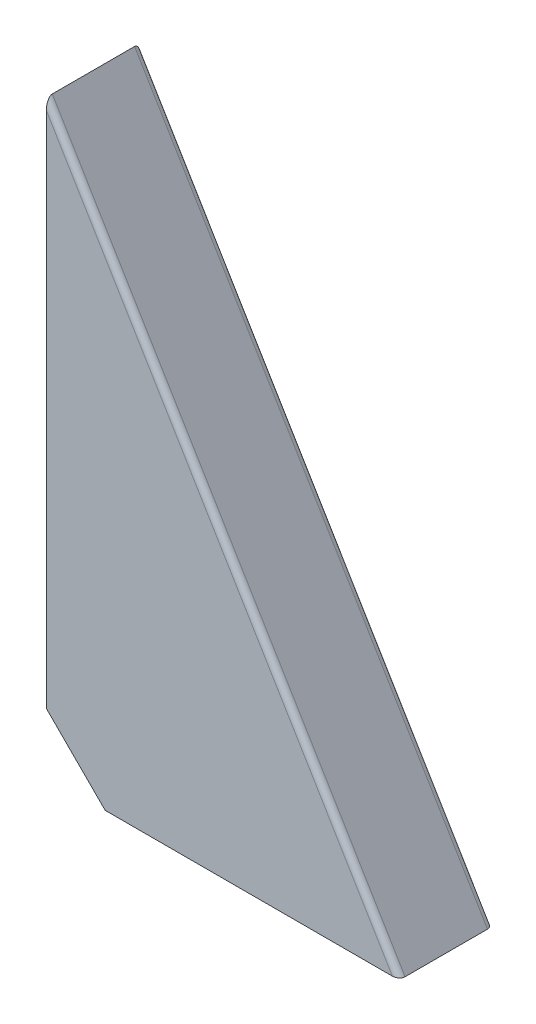
ISO-10303-21;
HEADER;
FILE_DESCRIPTION(('STEP AP214'),'2;1');
FILE_NAME('part.step','',(''),(''),'','','');
FILE_SCHEMA(('AUTOMOTIVE_DESIGN { 1 0 10303 214 1 1 1 1 }'));
ENDSEC;
DATA;
#1=APPLICATION_CONTEXT('core data for automotive mechanical design processes');
#2=APPLICATION_PROTOCOL_DEFINITION('international standard','automotive_design',2000,#1);
#3=PRODUCT_CONTEXT('',#1,'mechanical');
#4=PRODUCT('Part','Part','',(#3));
#5=PRODUCT_RELATED_PRODUCT_CATEGORY('part','',(#4));
#6=PRODUCT_DEFINITION_FORMATION('','',#4);
#7=PRODUCT_DEFINITION_CONTEXT('part definition',#1,'design');
#8=PRODUCT_DEFINITION('design','',#6,#7);
#9=PRODUCT_DEFINITION_SHAPE('','',#8);
#10=(LENGTH_UNIT() NAMED_UNIT(*) SI_UNIT(.MILLI.,.METRE.));
#11=(NAMED_UNIT(*) PLANE_ANGLE_UNIT() SI_UNIT($,.RADIAN.));
#12=(NAMED_UNIT(*) SI_UNIT($,.STERADIAN.) SOLID_ANGLE_UNIT());
#13=UNCERTAINTY_MEASURE_WITH_UNIT(LENGTH_MEASURE(1.E-05),#10,'distance_accuracy_value','');
#14=(GEOMETRIC_REPRESENTATION_CONTEXT(3) GLOBAL_UNCERTAINTY_ASSIGNED_CONTEXT((#13)) GLOBAL_UNIT_ASSIGNED_CONTEXT((#10,
#11,#12)) REPRESENTATION_CONTEXT('',''));
#15=CARTESIAN_POINT('',(0.,0.,0.));
#16=DIRECTION('',(0.,0.,1.));
#17=DIRECTION('',(1.,0.,0.));
#18=AXIS2_PLACEMENT_3D('',#15,#16,#17);
#19=CARTESIAN_POINT('',(0.,100.,8.));
#20=DIRECTION('',(1.,0.,0.));
#21=DIRECTION('',(0.,0.,-1.));
#22=AXIS2_PLACEMENT_3D('',#19,#20,#21);
#23=PLANE('',#22);
#24=DIRECTION('',(0.,-1.,0.));
#25=VECTOR('',#24,1.);
#26=CARTESIAN_POINT('',(0.,100.,8.));
#27=LINE('',#26,#25);
#28=CARTESIAN_POINT('',(0.,98.0563493683849,8.));
#29=VERTEX_POINT('',#28);
#30=CARTESIAN_POINT('',(0.,10.,8.));
#31=VERTEX_POINT('',#30);
#32=EDGE_CURVE('E123',#29,#31,#27,.T.);
#33=ORIENTED_EDGE('',*,*,#32,.F.);
#34=CARTESIAN_POINT('',(0.,98.0563493683849,7.));
#35=DIRECTION('',(1.,0.,0.));
#36=DIRECTION('',(0.,-1.,0.));
#37=AXIS2_PLACEMENT_3D('',#34,#35,#36);
#38=ELLIPSE('',#37,1.9436506316151,1.);
#39=CARTESIAN_POINT('',(0.,100.,7.));
#40=VERTEX_POINT('',#39);
#41=EDGE_CURVE('E140',#29,#40,#38,.F.);
#42=ORIENTED_EDGE('',*,*,#41,.T.);
#43=DIRECTION('',(0.,0.,-1.));
#44=VECTOR('',#43,1.);
#45=CARTESIAN_POINT('',(0.,100.,8.));
#46=LINE('',#45,#44);
#47=CARTESIAN_POINT('',(0.,100.,-7.));
#48=VERTEX_POINT('',#47);
#49=EDGE_CURVE('E130',#40,#48,#46,.T.);
#50=ORIENTED_EDGE('',*,*,#49,.T.);
#51=CARTESIAN_POINT('',(0.,98.0563493683849,-7.));
#52=DIRECTION('',(1.,0.,0.));
#53=DIRECTION('',(0.,1.,0.));
#54=AXIS2_PLACEMENT_3D('',#51,#52,#53);
#55=ELLIPSE('',#54,1.9436506316151,1.);
#56=CARTESIAN_POINT('',(0.,98.0563493683849,-8.));
#57=VERTEX_POINT('',#56);
#58=EDGE_CURVE('E138',#48,#57,#55,.F.);
#59=ORIENTED_EDGE('',*,*,#58,.T.);
#60=DIRECTION('',(0.,-1.,0.));
#61=VECTOR('',#60,1.);
#62=CARTESIAN_POINT('',(0.,100.,-8.));
#63=LINE('',#62,#61);
#64=CARTESIAN_POINT('',(0.,9.99999999999999,-8.));
#65=VERTEX_POINT('',#64);
#66=EDGE_CURVE('E124',#57,#65,#63,.T.);
#67=ORIENTED_EDGE('',*,*,#66,.T.);
#68=DIRECTION('',(0.,0.,1.));
#69=VECTOR('',#68,1.);
#70=CARTESIAN_POINT('',(0.,10.,-8.));
#71=LINE('',#70,#69);
#72=EDGE_CURVE('E113',#65,#31,#71,.T.);
#73=ORIENTED_EDGE('',*,*,#72,.T.);
#74=EDGE_LOOP('',(#33,#42,#50,#59,#67,#73));
#75=FACE_BOUND('',#74,.T.);
#76=ADVANCED_FACE('F52',(#75),#23,.F.);
#77=CARTESIAN_POINT('',(0.,0.,8.));
#78=DIRECTION('',(0.,1.,0.));
#79=DIRECTION('',(0.,0.,1.));
#80=AXIS2_PLACEMENT_3D('',#77,#78,#79);
#81=PLANE('',#80);
#82=DIRECTION('',(0.,0.,-1.));
#83=VECTOR('',#82,1.);
#84=CARTESIAN_POINT('',(60.,0.,8.));
#85=LINE('',#84,#83);
#86=CARTESIAN_POINT('',(60.,0.,7.));
#87=VERTEX_POINT('',#86);
#88=CARTESIAN_POINT('',(60.,0.,-7.));
#89=VERTEX_POINT('',#88);
#90=EDGE_CURVE('E133',#87,#89,#85,.T.);
#91=ORIENTED_EDGE('',*,*,#90,.F.);
#92=CARTESIAN_POINT('',(58.8338096210309,0.,7.));
#93=DIRECTION('',(0.,1.,0.));
#94=DIRECTION('',(1.,0.,0.));
#95=AXIS2_PLACEMENT_3D('',#92,#93,#94);
#96=ELLIPSE('',#95,1.16619037896906,1.);
#97=CARTESIAN_POINT('',(58.8338096210309,0.,8.));
#98=VERTEX_POINT('',#97);
#99=EDGE_CURVE('E60',#87,#98,#96,.F.);
#100=ORIENTED_EDGE('',*,*,#99,.T.);
#101=DIRECTION('',(1.,0.,0.));
#102=VECTOR('',#101,1.);
#103=CARTESIAN_POINT('',(0.,0.,8.));
#104=LINE('',#103,#102);
#105=CARTESIAN_POINT('',(10.,0.,8.));
#106=VERTEX_POINT('',#105);
#107=EDGE_CURVE('E120',#106,#98,#104,.T.);
#108=ORIENTED_EDGE('',*,*,#107,.F.);
#109=DIRECTION('',(0.,0.,1.));
#110=VECTOR('',#109,1.);
#111=CARTESIAN_POINT('',(10.,0.,-8.));
#112=LINE('',#111,#110);
#113=CARTESIAN_POINT('',(10.,0.,-8.));
#114=VERTEX_POINT('',#113);
#115=EDGE_CURVE('E110',#114,#106,#112,.T.);
#116=ORIENTED_EDGE('',*,*,#115,.F.);
#117=DIRECTION('',(1.,0.,0.));
#118=VECTOR('',#117,1.);
#119=CARTESIAN_POINT('',(0.,0.,-8.));
#120=LINE('',#119,#118);
#121=CARTESIAN_POINT('',(58.8338096210309,0.,-8.));
#122=VERTEX_POINT('',#121);
#123=EDGE_CURVE('E118',#114,#122,#120,.T.);
#124=ORIENTED_EDGE('',*,*,#123,.T.);
#125=CARTESIAN_POINT('',(58.8338096210309,0.,-7.));
#126=DIRECTION('',(0.,1.,0.));
#127=DIRECTION('',(-1.,0.,0.));
#128=AXIS2_PLACEMENT_3D('',#125,#126,#127);
#129=ELLIPSE('',#128,1.16619037896906,1.);
#130=EDGE_CURVE('E72',#122,#89,#129,.F.);
#131=ORIENTED_EDGE('',*,*,#130,.T.);
#132=EDGE_LOOP('',(#91,#100,#108,#116,#124,#131));
#133=FACE_BOUND('',#132,.T.);
#134=ADVANCED_FACE('F117',(#133),#81,.F.);
#135=CARTESIAN_POINT('',(60.,0.,8.));
#136=DIRECTION('',(-0.857492925712544,-0.514495755427527,0.));
#137=DIRECTION('',(0.514495755427526,-0.857492925712544,0.));
#138=AXIS2_PLACEMENT_3D('',#135,#136,#137);
#139=PLANE('',#138);
#140=ORIENTED_EDGE('',*,*,#49,.F.);
#141=DIRECTION('',(-0.514495755427526,0.857492925712544,0.));
#142=VECTOR('',#141,1.);
#143=CARTESIAN_POINT('',(60.,0.,7.));
#144=LINE('',#143,#142);
#145=EDGE_CURVE('E145',#40,#87,#144,.F.);
#146=ORIENTED_EDGE('',*,*,#145,.T.);
#147=ORIENTED_EDGE('',*,*,#90,.T.);
#148=DIRECTION('',(-0.514495755427526,0.857492925712544,0.));
#149=VECTOR('',#148,1.);
#150=CARTESIAN_POINT('',(60.,0.,-7.));
#151=LINE('',#150,#149);
#152=EDGE_CURVE('E142',#89,#48,#151,.T.);
#153=ORIENTED_EDGE('',*,*,#152,.T.);
#154=EDGE_LOOP('',(#140,#146,#147,#153));
#155=FACE_BOUND('',#154,.T.);
#156=ADVANCED_FACE('F158',(#155),#139,.F.);
#157=CARTESIAN_POINT('',(0.,0.,8.));
#158=DIRECTION('',(0.,0.,1.));
#159=DIRECTION('',(1.,0.,0.));
#160=AXIS2_PLACEMENT_3D('',#157,#158,#159);
#161=PLANE('',#160);
#162=ORIENTED_EDGE('',*,*,#107,.T.);
#163=DIRECTION('',(-0.514495755427526,0.857492925712544,0.));
#164=VECTOR('',#163,1.);
#165=CARTESIAN_POINT('',(-0.857492925712529,99.4855042445725,8.));
#166=LINE('',#165,#164);
#167=EDGE_CURVE('E135',#98,#29,#166,.T.);
#168=ORIENTED_EDGE('',*,*,#167,.T.);
#169=ORIENTED_EDGE('',*,*,#32,.T.);
#170=DIRECTION('',(-0.707106781186548,0.707106781186547,0.));
#171=VECTOR('',#170,1.);
#172=CARTESIAN_POINT('',(0.,10.,8.));
#173=LINE('',#172,#171);
#174=EDGE_CURVE('E114',#106,#31,#173,.T.);
#175=ORIENTED_EDGE('',*,*,#174,.F.);
#176=EDGE_LOOP('',(#162,#168,#169,#175));
#177=FACE_BOUND('',#176,.T.);
#178=ADVANCED_FACE('F152',(#177),#161,.T.);
#179=CARTESIAN_POINT('',(0.,0.,-8.));
#180=DIRECTION('',(0.,0.,1.));
#181=DIRECTION('',(1.,0.,0.));
#182=AXIS2_PLACEMENT_3D('',#179,#180,#181);
#183=PLANE('',#182);
#184=ORIENTED_EDGE('',*,*,#66,.F.);
#185=DIRECTION('',(-0.514495755427526,0.857492925712544,0.));
#186=VECTOR('',#185,1.);
#187=CARTESIAN_POINT('',(43.260154133111,25.9560924798666,-8.));
#188=LINE('',#187,#186);
#189=EDGE_CURVE('E12',#57,#122,#188,.F.);
#190=ORIENTED_EDGE('',*,*,#189,.T.);
#191=ORIENTED_EDGE('',*,*,#123,.F.);
#192=DIRECTION('',(-0.707106781186548,0.707106781186547,0.));
#193=VECTOR('',#192,1.);
#194=CARTESIAN_POINT('',(0.,10.,-8.));
#195=LINE('',#194,#193);
#196=EDGE_CURVE('E106',#114,#65,#195,.T.);
#197=ORIENTED_EDGE('',*,*,#196,.T.);
#198=EDGE_LOOP('',(#184,#190,#191,#197));
#199=FACE_BOUND('',#198,.T.);
#200=ADVANCED_FACE('F122',(#199),#183,.F.);
#201=CARTESIAN_POINT('',(0.,10.,-8.));
#202=DIRECTION('',(0.707106781186547,0.707106781186548,0.));
#203=DIRECTION('',(-0.707106781186548,0.707106781186547,0.));
#204=AXIS2_PLACEMENT_3D('',#201,#202,#203);
#205=PLANE('',#204);
#206=ORIENTED_EDGE('',*,*,#174,.T.);
#207=ORIENTED_EDGE('',*,*,#72,.F.);
#208=ORIENTED_EDGE('',*,*,#196,.F.);
#209=ORIENTED_EDGE('',*,*,#115,.T.);
#210=EDGE_LOOP('',(#206,#207,#208,#209));
#211=FACE_BOUND('',#210,.T.);
#212=ADVANCED_FACE('F109',(#211),#205,.F.);
#213=CARTESIAN_POINT('',(43.260154133111,25.9560924798666,7.));
#214=DIRECTION('',(0.514495755427526,-0.857492925712544,0.));
#215=DIRECTION('',(0.857492925712544,0.514495755427527,0.));
#216=AXIS2_PLACEMENT_3D('',#213,#214,#215);
#217=CYLINDRICAL_SURFACE('',#216,1.);
#218=ORIENTED_EDGE('',*,*,#99,.F.);
#219=ORIENTED_EDGE('',*,*,#145,.F.);
#220=ORIENTED_EDGE('',*,*,#41,.F.);
#221=ORIENTED_EDGE('',*,*,#167,.F.);
#222=EDGE_LOOP('',(#218,#219,#220,#221));
#223=FACE_BOUND('',#222,.T.);
#224=ADVANCED_FACE('F154',(#223),#217,.T.);
#225=CARTESIAN_POINT('',(59.1425070742875,-0.514495755427527,-7.));
#226=DIRECTION('',(-0.514495755427526,0.857492925712544,0.));
#227=DIRECTION('',(-0.857492925712544,-0.514495755427527,0.));
#228=AXIS2_PLACEMENT_3D('',#225,#226,#227);
#229=CYLINDRICAL_SURFACE('',#228,1.);
#230=ORIENTED_EDGE('',*,*,#130,.F.);
#231=ORIENTED_EDGE('',*,*,#189,.F.);
#232=ORIENTED_EDGE('',*,*,#58,.F.);
#233=ORIENTED_EDGE('',*,*,#152,.F.);
#234=EDGE_LOOP('',(#230,#231,#232,#233));
#235=FACE_BOUND('',#234,.T.);
#236=ADVANCED_FACE('F54',(#235),#229,.T.);
#237=CLOSED_SHELL('',(#76,#134,#156,#178,#200,#212,#224,#236));
#238=MANIFOLD_SOLID_BREP('B2',#237);
#239=ADVANCED_BREP_SHAPE_REPRESENTATION('',(#18,#238),#14);
#240=SHAPE_DEFINITION_REPRESENTATION(#9,#239);
ENDSEC;
END-ISO-10303-21;
